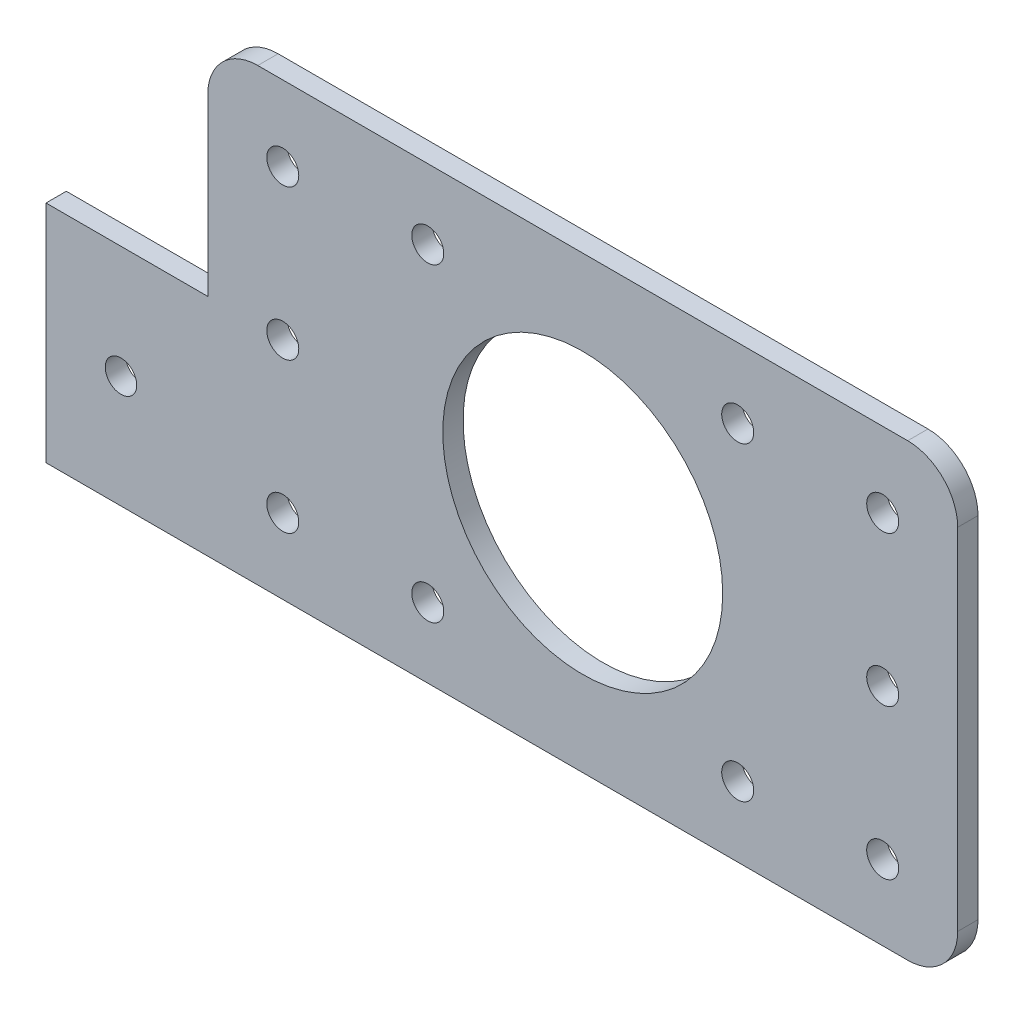
ISO-10303-21;
HEADER;
FILE_DESCRIPTION(('STEP AP214'),'2;1');
FILE_NAME('part.step','',(''),(''),'','','');
FILE_SCHEMA(('AUTOMOTIVE_DESIGN { 1 0 10303 214 1 1 1 1 }'));
ENDSEC;
DATA;
#1=APPLICATION_CONTEXT('core data for automotive mechanical design processes');
#2=APPLICATION_PROTOCOL_DEFINITION('international standard','automotive_design',2000,#1);
#3=PRODUCT_CONTEXT('',#1,'mechanical');
#4=PRODUCT('Part','Part','',(#3));
#5=PRODUCT_RELATED_PRODUCT_CATEGORY('part','',(#4));
#6=PRODUCT_DEFINITION_FORMATION('','',#4);
#7=PRODUCT_DEFINITION_CONTEXT('part definition',#1,'design');
#8=PRODUCT_DEFINITION('design','',#6,#7);
#9=PRODUCT_DEFINITION_SHAPE('','',#8);
#10=(LENGTH_UNIT() NAMED_UNIT(*) SI_UNIT(.MILLI.,.METRE.));
#11=(NAMED_UNIT(*) PLANE_ANGLE_UNIT() SI_UNIT($,.RADIAN.));
#12=(NAMED_UNIT(*) SI_UNIT($,.STERADIAN.) SOLID_ANGLE_UNIT());
#13=UNCERTAINTY_MEASURE_WITH_UNIT(LENGTH_MEASURE(1.E-05),#10,'distance_accuracy_value','');
#14=(GEOMETRIC_REPRESENTATION_CONTEXT(3) GLOBAL_UNCERTAINTY_ASSIGNED_CONTEXT((#13)) GLOBAL_UNIT_ASSIGNED_CONTEXT((#10,
#11,#12)) REPRESENTATION_CONTEXT('',''));
#15=CARTESIAN_POINT('',(0.,0.,0.));
#16=DIRECTION('',(0.,0.,1.));
#17=DIRECTION('',(1.,0.,0.));
#18=AXIS2_PLACEMENT_3D('',#15,#16,#17);
#19=CARTESIAN_POINT('',(0.,0.,2.032));
#20=DIRECTION('',(0.,0.,-1.));
#21=DIRECTION('',(-1.,0.,0.));
#22=AXIS2_PLACEMENT_3D('',#19,#20,#21);
#23=PLANE('',#22);
#24=CARTESIAN_POINT('',(-46.18,-11.25,2.032));
#25=DIRECTION('',(0.,0.,1.));
#26=DIRECTION('',(1.,0.,0.));
#27=AXIS2_PLACEMENT_3D('',#24,#25,#26);
#28=CIRCLE('',#27,1.575);
#29=CARTESIAN_POINT('',(-44.605,-11.25,2.032));
#30=VERTEX_POINT('',#29);
#31=EDGE_CURVE('E135',#30,#30,#28,.T.);
#32=ORIENTED_EDGE('',*,*,#31,.F.);
#33=EDGE_LOOP('',(#32));
#34=FACE_BOUND('',#33,.T.);
#35=DIRECTION('',(0.,-1.,0.));
#36=VECTOR('',#35,1.);
#37=CARTESIAN_POINT('',(-53.68,0.,2.032));
#38=LINE('',#37,#36);
#39=CARTESIAN_POINT('',(-53.68,0.,2.032));
#40=VERTEX_POINT('',#39);
#41=CARTESIAN_POINT('',(-53.68,-22.5,2.032));
#42=VERTEX_POINT('',#41);
#43=EDGE_CURVE('E141',#40,#42,#38,.T.);
#44=ORIENTED_EDGE('',*,*,#43,.T.);
#45=DIRECTION('',(1.,0.,0.));
#46=VECTOR('',#45,1.);
#47=CARTESIAN_POINT('',(-37.5,-22.5,2.032));
#48=LINE('',#47,#46);
#49=CARTESIAN_POINT('',(32.5,-22.5,2.032));
#50=VERTEX_POINT('',#49);
#51=EDGE_CURVE('E122',#42,#50,#48,.T.);
#52=ORIENTED_EDGE('',*,*,#51,.T.);
#53=CARTESIAN_POINT('',(32.5,-17.5,2.032));
#54=DIRECTION('',(0.,0.,-1.));
#55=DIRECTION('',(-1.,0.,0.));
#56=AXIS2_PLACEMENT_3D('',#53,#54,#55);
#57=CIRCLE('',#56,5.);
#58=CARTESIAN_POINT('',(37.5,-17.5,2.032));
#59=VERTEX_POINT('',#58);
#60=EDGE_CURVE('E240',#50,#59,#57,.F.);
#61=ORIENTED_EDGE('',*,*,#60,.T.);
#62=DIRECTION('',(0.,1.,0.));
#63=VECTOR('',#62,1.);
#64=CARTESIAN_POINT('',(37.5,-22.5,2.032));
#65=LINE('',#64,#63);
#66=CARTESIAN_POINT('',(37.5,17.5,2.032));
#67=VERTEX_POINT('',#66);
#68=EDGE_CURVE('E116',#59,#67,#65,.T.);
#69=ORIENTED_EDGE('',*,*,#68,.T.);
#70=CARTESIAN_POINT('',(32.5,17.5,2.032));
#71=DIRECTION('',(0.,0.,-1.));
#72=DIRECTION('',(-1.,0.,0.));
#73=AXIS2_PLACEMENT_3D('',#70,#71,#72);
#74=CIRCLE('',#73,5.);
#75=CARTESIAN_POINT('',(32.5,22.5,2.032));
#76=VERTEX_POINT('',#75);
#77=EDGE_CURVE('E242',#67,#76,#74,.F.);
#78=ORIENTED_EDGE('',*,*,#77,.T.);
#79=DIRECTION('',(-1.,0.,0.));
#80=VECTOR('',#79,1.);
#81=CARTESIAN_POINT('',(-37.5,22.5,2.032));
#82=LINE('',#81,#80);
#83=CARTESIAN_POINT('',(-32.5,22.5,2.032));
#84=VERTEX_POINT('',#83);
#85=EDGE_CURVE('E212',#76,#84,#82,.T.);
#86=ORIENTED_EDGE('',*,*,#85,.T.);
#87=CARTESIAN_POINT('',(-32.5,17.5,2.032));
#88=DIRECTION('',(0.,0.,-1.));
#89=DIRECTION('',(-1.,0.,0.));
#90=AXIS2_PLACEMENT_3D('',#87,#88,#89);
#91=CIRCLE('',#90,5.);
#92=CARTESIAN_POINT('',(-37.5,17.5,2.032));
#93=VERTEX_POINT('',#92);
#94=EDGE_CURVE('E56',#84,#93,#91,.F.);
#95=ORIENTED_EDGE('',*,*,#94,.T.);
#96=DIRECTION('',(0.,-1.,0.));
#97=VECTOR('',#96,1.);
#98=CARTESIAN_POINT('',(-37.5,-22.5,2.032));
#99=LINE('',#98,#97);
#100=CARTESIAN_POINT('',(-37.5,0.,2.032));
#101=VERTEX_POINT('',#100);
#102=EDGE_CURVE('E214',#93,#101,#99,.T.);
#103=ORIENTED_EDGE('',*,*,#102,.T.);
#104=DIRECTION('',(-1.,0.,0.));
#105=VECTOR('',#104,1.);
#106=CARTESIAN_POINT('',(-53.68,0.,2.032));
#107=LINE('',#106,#105);
#108=EDGE_CURVE('E138',#101,#40,#107,.T.);
#109=ORIENTED_EDGE('',*,*,#108,.T.);
#110=EDGE_LOOP('',(#44,#52,#61,#69,#78,#86,#95,#103,#109));
#111=FACE_BOUND('',#110,.T.);
#112=CARTESIAN_POINT('',(30.,0.,2.032));
#113=DIRECTION('',(0.,0.,1.));
#114=DIRECTION('',(-1.,0.,0.));
#115=AXIS2_PLACEMENT_3D('',#112,#113,#114);
#116=CIRCLE('',#115,1.60000000000001);
#117=CARTESIAN_POINT('',(28.4,0.,2.032));
#118=VERTEX_POINT('',#117);
#119=EDGE_CURVE('E147',#118,#118,#116,.T.);
#120=ORIENTED_EDGE('',*,*,#119,.F.);
#121=EDGE_LOOP('',(#120));
#122=FACE_BOUND('',#121,.T.);
#123=CARTESIAN_POINT('',(30.,15.,2.032));
#124=DIRECTION('',(0.,0.,1.));
#125=DIRECTION('',(-1.,0.,0.));
#126=AXIS2_PLACEMENT_3D('',#123,#124,#125);
#127=CIRCLE('',#126,1.6);
#128=CARTESIAN_POINT('',(28.4,15.,2.032));
#129=VERTEX_POINT('',#128);
#130=EDGE_CURVE('E146',#129,#129,#127,.T.);
#131=ORIENTED_EDGE('',*,*,#130,.F.);
#132=EDGE_LOOP('',(#131));
#133=FACE_BOUND('',#132,.T.);
#134=CARTESIAN_POINT('',(30.,-15.,2.032));
#135=DIRECTION('',(0.,0.,1.));
#136=DIRECTION('',(1.,0.,0.));
#137=AXIS2_PLACEMENT_3D('',#134,#135,#136);
#138=CIRCLE('',#137,1.60000000000001);
#139=CARTESIAN_POINT('',(31.6,-15.,2.032));
#140=VERTEX_POINT('',#139);
#141=EDGE_CURVE('E153',#140,#140,#138,.T.);
#142=ORIENTED_EDGE('',*,*,#141,.F.);
#143=EDGE_LOOP('',(#142));
#144=FACE_BOUND('',#143,.T.);
#145=CARTESIAN_POINT('',(-30.,-15.,2.032));
#146=DIRECTION('',(0.,0.,1.));
#147=DIRECTION('',(-1.,0.,0.));
#148=AXIS2_PLACEMENT_3D('',#145,#146,#147);
#149=CIRCLE('',#148,1.6);
#150=CARTESIAN_POINT('',(-31.6,-15.,2.032));
#151=VERTEX_POINT('',#150);
#152=EDGE_CURVE('E159',#151,#151,#149,.T.);
#153=ORIENTED_EDGE('',*,*,#152,.F.);
#154=EDGE_LOOP('',(#153));
#155=FACE_BOUND('',#154,.T.);
#156=CARTESIAN_POINT('',(-30.,15.,2.032));
#157=DIRECTION('',(0.,0.,1.));
#158=DIRECTION('',(1.,0.,0.));
#159=AXIS2_PLACEMENT_3D('',#156,#157,#158);
#160=CIRCLE('',#159,1.6);
#161=CARTESIAN_POINT('',(-28.4,15.,2.032));
#162=VERTEX_POINT('',#161);
#163=EDGE_CURVE('E165',#162,#162,#160,.T.);
#164=ORIENTED_EDGE('',*,*,#163,.F.);
#165=EDGE_LOOP('',(#164));
#166=FACE_BOUND('',#165,.T.);
#167=CARTESIAN_POINT('',(-30.,0.,2.032));
#168=DIRECTION('',(0.,0.,1.));
#169=DIRECTION('',(1.,0.,0.));
#170=AXIS2_PLACEMENT_3D('',#167,#168,#169);
#171=CIRCLE('',#170,1.60000000000001);
#172=CARTESIAN_POINT('',(-28.4,0.,2.032));
#173=VERTEX_POINT('',#172);
#174=EDGE_CURVE('E171',#173,#173,#171,.T.);
#175=ORIENTED_EDGE('',*,*,#174,.F.);
#176=EDGE_LOOP('',(#175));
#177=FACE_BOUND('',#176,.T.);
#178=CARTESIAN_POINT('',(15.5,-15.5,2.032));
#179=DIRECTION('',(0.,0.,1.));
#180=DIRECTION('',(1.,0.,0.));
#181=AXIS2_PLACEMENT_3D('',#178,#179,#180);
#182=CIRCLE('',#181,1.6);
#183=CARTESIAN_POINT('',(17.1,-15.5,2.032));
#184=VERTEX_POINT('',#183);
#185=EDGE_CURVE('E186',#184,#184,#182,.T.);
#186=ORIENTED_EDGE('',*,*,#185,.F.);
#187=EDGE_LOOP('',(#186));
#188=FACE_BOUND('',#187,.T.);
#189=CARTESIAN_POINT('',(-15.5,15.5,2.032));
#190=DIRECTION('',(0.,0.,1.));
#191=DIRECTION('',(1.,0.,0.));
#192=AXIS2_PLACEMENT_3D('',#189,#190,#191);
#193=CIRCLE('',#192,1.6);
#194=CARTESIAN_POINT('',(-13.9,15.5,2.032));
#195=VERTEX_POINT('',#194);
#196=EDGE_CURVE('E198',#195,#195,#193,.T.);
#197=ORIENTED_EDGE('',*,*,#196,.F.);
#198=EDGE_LOOP('',(#197));
#199=FACE_BOUND('',#198,.T.);
#200=CARTESIAN_POINT('',(0.,0.,2.032));
#201=DIRECTION('',(0.,0.,1.));
#202=DIRECTION('',(1.,0.,0.));
#203=AXIS2_PLACEMENT_3D('',#200,#201,#202);
#204=CIRCLE('',#203,14.);
#205=CARTESIAN_POINT('',(14.,0.,2.032));
#206=VERTEX_POINT('',#205);
#207=EDGE_CURVE('E204',#206,#206,#204,.T.);
#208=ORIENTED_EDGE('',*,*,#207,.F.);
#209=EDGE_LOOP('',(#208));
#210=FACE_BOUND('',#209,.T.);
#211=CARTESIAN_POINT('',(15.5,15.5,2.032));
#212=DIRECTION('',(0.,0.,1.));
#213=DIRECTION('',(1.,0.,0.));
#214=AXIS2_PLACEMENT_3D('',#211,#212,#213);
#215=CIRCLE('',#214,1.6);
#216=CARTESIAN_POINT('',(17.1,15.5,2.032));
#217=VERTEX_POINT('',#216);
#218=EDGE_CURVE('E192',#217,#217,#215,.T.);
#219=ORIENTED_EDGE('',*,*,#218,.F.);
#220=EDGE_LOOP('',(#219));
#221=FACE_BOUND('',#220,.T.);
#222=CARTESIAN_POINT('',(-15.5,-15.5,2.032));
#223=DIRECTION('',(0.,0.,1.));
#224=DIRECTION('',(1.,0.,0.));
#225=AXIS2_PLACEMENT_3D('',#222,#223,#224);
#226=CIRCLE('',#225,1.6);
#227=CARTESIAN_POINT('',(-13.9,-15.5,2.032));
#228=VERTEX_POINT('',#227);
#229=EDGE_CURVE('E180',#228,#228,#226,.T.);
#230=ORIENTED_EDGE('',*,*,#229,.F.);
#231=EDGE_LOOP('',(#230));
#232=FACE_BOUND('',#231,.T.);
#233=ADVANCED_FACE('F33',(#34,#111,#122,#133,#144,#155,#166,#177,#188,#199,#210,#221,#232),#23,.F.);
#234=CARTESIAN_POINT('',(0.,0.,0.));
#235=DIRECTION('',(0.,0.,-1.));
#236=DIRECTION('',(-1.,0.,0.));
#237=AXIS2_PLACEMENT_3D('',#234,#235,#236);
#238=PLANE('',#237);
#239=CARTESIAN_POINT('',(-46.18,-11.25,0.));
#240=DIRECTION('',(0.,0.,1.));
#241=DIRECTION('',(1.,0.,0.));
#242=AXIS2_PLACEMENT_3D('',#239,#240,#241);
#243=CIRCLE('',#242,1.575);
#244=CARTESIAN_POINT('',(-44.605,-11.25,0.));
#245=VERTEX_POINT('',#244);
#246=EDGE_CURVE('E131',#245,#245,#243,.T.);
#247=ORIENTED_EDGE('',*,*,#246,.T.);
#248=EDGE_LOOP('',(#247));
#249=FACE_BOUND('',#248,.T.);
#250=DIRECTION('',(1.,0.,0.));
#251=VECTOR('',#250,1.);
#252=CARTESIAN_POINT('',(-37.5,-22.5,0.));
#253=LINE('',#252,#251);
#254=CARTESIAN_POINT('',(-53.68,-22.5,0.));
#255=VERTEX_POINT('',#254);
#256=CARTESIAN_POINT('',(32.5,-22.5,0.));
#257=VERTEX_POINT('',#256);
#258=EDGE_CURVE('E106',#255,#257,#253,.T.);
#259=ORIENTED_EDGE('',*,*,#258,.F.);
#260=DIRECTION('',(0.,1.,0.));
#261=VECTOR('',#260,1.);
#262=CARTESIAN_POINT('',(-53.68,0.,0.));
#263=LINE('',#262,#261);
#264=CARTESIAN_POINT('',(-53.68,0.,0.));
#265=VERTEX_POINT('',#264);
#266=EDGE_CURVE('E112',#255,#265,#263,.T.);
#267=ORIENTED_EDGE('',*,*,#266,.T.);
#268=DIRECTION('',(1.,0.,0.));
#269=VECTOR('',#268,1.);
#270=CARTESIAN_POINT('',(-53.68,0.,0.));
#271=LINE('',#270,#269);
#272=CARTESIAN_POINT('',(-37.5,0.,0.));
#273=VERTEX_POINT('',#272);
#274=EDGE_CURVE('E127',#265,#273,#271,.T.);
#275=ORIENTED_EDGE('',*,*,#274,.T.);
#276=DIRECTION('',(0.,-1.,0.));
#277=VECTOR('',#276,1.);
#278=CARTESIAN_POINT('',(-37.5,-22.5,0.));
#279=LINE('',#278,#277);
#280=CARTESIAN_POINT('',(-37.5,17.5,0.));
#281=VERTEX_POINT('',#280);
#282=EDGE_CURVE('E117',#281,#273,#279,.T.);
#283=ORIENTED_EDGE('',*,*,#282,.F.);
#284=CARTESIAN_POINT('',(-32.5,17.5,0.));
#285=DIRECTION('',(0.,0.,-1.));
#286=DIRECTION('',(-1.,0.,0.));
#287=AXIS2_PLACEMENT_3D('',#284,#285,#286);
#288=CIRCLE('',#287,5.);
#289=CARTESIAN_POINT('',(-32.5,22.5,0.));
#290=VERTEX_POINT('',#289);
#291=EDGE_CURVE('E229',#281,#290,#288,.T.);
#292=ORIENTED_EDGE('',*,*,#291,.T.);
#293=DIRECTION('',(-1.,0.,0.));
#294=VECTOR('',#293,1.);
#295=CARTESIAN_POINT('',(-37.5,22.5,0.));
#296=LINE('',#295,#294);
#297=CARTESIAN_POINT('',(32.5,22.5,0.));
#298=VERTEX_POINT('',#297);
#299=EDGE_CURVE('E220',#298,#290,#296,.T.);
#300=ORIENTED_EDGE('',*,*,#299,.F.);
#301=CARTESIAN_POINT('',(32.5,17.5,0.));
#302=DIRECTION('',(0.,0.,-1.));
#303=DIRECTION('',(-1.,0.,0.));
#304=AXIS2_PLACEMENT_3D('',#301,#302,#303);
#305=CIRCLE('',#304,5.);
#306=CARTESIAN_POINT('',(37.5,17.5,0.));
#307=VERTEX_POINT('',#306);
#308=EDGE_CURVE('E232',#298,#307,#305,.T.);
#309=ORIENTED_EDGE('',*,*,#308,.T.);
#310=DIRECTION('',(0.,1.,0.));
#311=VECTOR('',#310,1.);
#312=CARTESIAN_POINT('',(37.5,-22.5,0.));
#313=LINE('',#312,#311);
#314=CARTESIAN_POINT('',(37.5,-17.5,0.));
#315=VERTEX_POINT('',#314);
#316=EDGE_CURVE('E207',#315,#307,#313,.T.);
#317=ORIENTED_EDGE('',*,*,#316,.F.);
#318=CARTESIAN_POINT('',(32.5,-17.5,0.));
#319=DIRECTION('',(0.,0.,-1.));
#320=DIRECTION('',(-1.,0.,0.));
#321=AXIS2_PLACEMENT_3D('',#318,#319,#320);
#322=CIRCLE('',#321,5.);
#323=EDGE_CURVE('E115',#315,#257,#322,.T.);
#324=ORIENTED_EDGE('',*,*,#323,.T.);
#325=EDGE_LOOP('',(#259,#267,#275,#283,#292,#300,#309,#317,#324));
#326=FACE_BOUND('',#325,.T.);
#327=CARTESIAN_POINT('',(30.,0.,0.));
#328=DIRECTION('',(0.,0.,1.));
#329=DIRECTION('',(-1.,0.,0.));
#330=AXIS2_PLACEMENT_3D('',#327,#328,#329);
#331=CIRCLE('',#330,1.60000000000001);
#332=CARTESIAN_POINT('',(28.4,0.,0.));
#333=VERTEX_POINT('',#332);
#334=EDGE_CURVE('E143',#333,#333,#331,.T.);
#335=ORIENTED_EDGE('',*,*,#334,.T.);
#336=EDGE_LOOP('',(#335));
#337=FACE_BOUND('',#336,.T.);
#338=CARTESIAN_POINT('',(30.,15.,0.));
#339=DIRECTION('',(0.,0.,1.));
#340=DIRECTION('',(-1.,0.,0.));
#341=AXIS2_PLACEMENT_3D('',#338,#339,#340);
#342=CIRCLE('',#341,1.6);
#343=CARTESIAN_POINT('',(28.4,15.,0.));
#344=VERTEX_POINT('',#343);
#345=EDGE_CURVE('E150',#344,#344,#342,.T.);
#346=ORIENTED_EDGE('',*,*,#345,.T.);
#347=EDGE_LOOP('',(#346));
#348=FACE_BOUND('',#347,.T.);
#349=CARTESIAN_POINT('',(30.,-15.,0.));
#350=DIRECTION('',(0.,0.,1.));
#351=DIRECTION('',(1.,0.,0.));
#352=AXIS2_PLACEMENT_3D('',#349,#350,#351);
#353=CIRCLE('',#352,1.60000000000001);
#354=CARTESIAN_POINT('',(31.6,-15.,0.));
#355=VERTEX_POINT('',#354);
#356=EDGE_CURVE('E156',#355,#355,#353,.T.);
#357=ORIENTED_EDGE('',*,*,#356,.T.);
#358=EDGE_LOOP('',(#357));
#359=FACE_BOUND('',#358,.T.);
#360=CARTESIAN_POINT('',(-30.,-15.,0.));
#361=DIRECTION('',(0.,0.,1.));
#362=DIRECTION('',(-1.,0.,0.));
#363=AXIS2_PLACEMENT_3D('',#360,#361,#362);
#364=CIRCLE('',#363,1.6);
#365=CARTESIAN_POINT('',(-31.6,-15.,0.));
#366=VERTEX_POINT('',#365);
#367=EDGE_CURVE('E162',#366,#366,#364,.T.);
#368=ORIENTED_EDGE('',*,*,#367,.T.);
#369=EDGE_LOOP('',(#368));
#370=FACE_BOUND('',#369,.T.);
#371=CARTESIAN_POINT('',(-30.,15.,0.));
#372=DIRECTION('',(0.,0.,1.));
#373=DIRECTION('',(1.,0.,0.));
#374=AXIS2_PLACEMENT_3D('',#371,#372,#373);
#375=CIRCLE('',#374,1.6);
#376=CARTESIAN_POINT('',(-28.4,15.,0.));
#377=VERTEX_POINT('',#376);
#378=EDGE_CURVE('E168',#377,#377,#375,.T.);
#379=ORIENTED_EDGE('',*,*,#378,.T.);
#380=EDGE_LOOP('',(#379));
#381=FACE_BOUND('',#380,.T.);
#382=CARTESIAN_POINT('',(-30.,0.,0.));
#383=DIRECTION('',(0.,0.,1.));
#384=DIRECTION('',(1.,0.,0.));
#385=AXIS2_PLACEMENT_3D('',#382,#383,#384);
#386=CIRCLE('',#385,1.60000000000001);
#387=CARTESIAN_POINT('',(-28.4,0.,0.));
#388=VERTEX_POINT('',#387);
#389=EDGE_CURVE('E174',#388,#388,#386,.T.);
#390=ORIENTED_EDGE('',*,*,#389,.T.);
#391=EDGE_LOOP('',(#390));
#392=FACE_BOUND('',#391,.T.);
#393=CARTESIAN_POINT('',(15.5,-15.5,0.));
#394=DIRECTION('',(0.,0.,1.));
#395=DIRECTION('',(1.,0.,0.));
#396=AXIS2_PLACEMENT_3D('',#393,#394,#395);
#397=CIRCLE('',#396,1.6);
#398=CARTESIAN_POINT('',(17.1,-15.5,0.));
#399=VERTEX_POINT('',#398);
#400=EDGE_CURVE('E183',#399,#399,#397,.T.);
#401=ORIENTED_EDGE('',*,*,#400,.T.);
#402=EDGE_LOOP('',(#401));
#403=FACE_BOUND('',#402,.T.);
#404=CARTESIAN_POINT('',(-15.5,15.5,0.));
#405=DIRECTION('',(0.,0.,1.));
#406=DIRECTION('',(1.,0.,0.));
#407=AXIS2_PLACEMENT_3D('',#404,#405,#406);
#408=CIRCLE('',#407,1.6);
#409=CARTESIAN_POINT('',(-13.9,15.5,0.));
#410=VERTEX_POINT('',#409);
#411=EDGE_CURVE('E195',#410,#410,#408,.T.);
#412=ORIENTED_EDGE('',*,*,#411,.T.);
#413=EDGE_LOOP('',(#412));
#414=FACE_BOUND('',#413,.T.);
#415=CARTESIAN_POINT('',(0.,0.,0.));
#416=DIRECTION('',(0.,0.,1.));
#417=DIRECTION('',(1.,0.,0.));
#418=AXIS2_PLACEMENT_3D('',#415,#416,#417);
#419=CIRCLE('',#418,14.);
#420=CARTESIAN_POINT('',(14.,0.,0.));
#421=VERTEX_POINT('',#420);
#422=EDGE_CURVE('E201',#421,#421,#419,.T.);
#423=ORIENTED_EDGE('',*,*,#422,.T.);
#424=EDGE_LOOP('',(#423));
#425=FACE_BOUND('',#424,.T.);
#426=CARTESIAN_POINT('',(15.5,15.5,0.));
#427=DIRECTION('',(0.,0.,1.));
#428=DIRECTION('',(1.,0.,0.));
#429=AXIS2_PLACEMENT_3D('',#426,#427,#428);
#430=CIRCLE('',#429,1.6);
#431=CARTESIAN_POINT('',(17.1,15.5,0.));
#432=VERTEX_POINT('',#431);
#433=EDGE_CURVE('E189',#432,#432,#430,.T.);
#434=ORIENTED_EDGE('',*,*,#433,.T.);
#435=EDGE_LOOP('',(#434));
#436=FACE_BOUND('',#435,.T.);
#437=CARTESIAN_POINT('',(-15.5,-15.5,0.));
#438=DIRECTION('',(0.,0.,1.));
#439=DIRECTION('',(1.,0.,0.));
#440=AXIS2_PLACEMENT_3D('',#437,#438,#439);
#441=CIRCLE('',#440,1.6);
#442=CARTESIAN_POINT('',(-13.9,-15.5,0.));
#443=VERTEX_POINT('',#442);
#444=EDGE_CURVE('E177',#443,#443,#441,.T.);
#445=ORIENTED_EDGE('',*,*,#444,.T.);
#446=EDGE_LOOP('',(#445));
#447=FACE_BOUND('',#446,.T.);
#448=ADVANCED_FACE('F108',(#249,#326,#337,#348,#359,#370,#381,#392,#403,#414,#425,#436,#447),
#238,.T.);
#449=CARTESIAN_POINT('',(37.5,-22.5,2.032));
#450=DIRECTION('',(-1.,0.,0.));
#451=DIRECTION('',(0.,0.,1.));
#452=AXIS2_PLACEMENT_3D('',#449,#450,#451);
#453=PLANE('',#452);
#454=ORIENTED_EDGE('',*,*,#316,.T.);
#455=DIRECTION('',(0.,0.,-1.));
#456=VECTOR('',#455,1.);
#457=CARTESIAN_POINT('',(37.5,17.5,2.032));
#458=LINE('',#457,#456);
#459=EDGE_CURVE('E237',#307,#67,#458,.F.);
#460=ORIENTED_EDGE('',*,*,#459,.T.);
#461=ORIENTED_EDGE('',*,*,#68,.F.);
#462=DIRECTION('',(0.,0.,-1.));
#463=VECTOR('',#462,1.);
#464=CARTESIAN_POINT('',(37.5,-17.5,2.032));
#465=LINE('',#464,#463);
#466=EDGE_CURVE('E234',#59,#315,#465,.T.);
#467=ORIENTED_EDGE('',*,*,#466,.T.);
#468=EDGE_LOOP('',(#454,#460,#461,#467));
#469=FACE_BOUND('',#468,.T.);
#470=ADVANCED_FACE('F266',(#469),#453,.F.);
#471=CARTESIAN_POINT('',(-37.5,22.5,2.032));
#472=DIRECTION('',(0.,-1.,0.));
#473=DIRECTION('',(0.,0.,-1.));
#474=AXIS2_PLACEMENT_3D('',#471,#472,#473);
#475=PLANE('',#474);
#476=ORIENTED_EDGE('',*,*,#85,.F.);
#477=DIRECTION('',(0.,0.,-1.));
#478=VECTOR('',#477,1.);
#479=CARTESIAN_POINT('',(32.5,22.5,2.032));
#480=LINE('',#479,#478);
#481=EDGE_CURVE('E226',#76,#298,#480,.T.);
#482=ORIENTED_EDGE('',*,*,#481,.T.);
#483=ORIENTED_EDGE('',*,*,#299,.T.);
#484=DIRECTION('',(0.,0.,-1.));
#485=VECTOR('',#484,1.);
#486=CARTESIAN_POINT('',(-32.5,22.5,2.032));
#487=LINE('',#486,#485);
#488=EDGE_CURVE('E217',#290,#84,#487,.F.);
#489=ORIENTED_EDGE('',*,*,#488,.T.);
#490=EDGE_LOOP('',(#476,#482,#483,#489));
#491=FACE_BOUND('',#490,.T.);
#492=ADVANCED_FACE('F277',(#491),#475,.F.);
#493=CARTESIAN_POINT('',(-37.5,-22.5,2.032));
#494=DIRECTION('',(1.,0.,0.));
#495=DIRECTION('',(0.,0.,-1.));
#496=AXIS2_PLACEMENT_3D('',#493,#494,#495);
#497=PLANE('',#496);
#498=ORIENTED_EDGE('',*,*,#282,.T.);
#499=DIRECTION('',(0.,0.,1.));
#500=VECTOR('',#499,1.);
#501=CARTESIAN_POINT('',(-37.5,0.,2.032));
#502=LINE('',#501,#500);
#503=EDGE_CURVE('E11',#273,#101,#502,.T.);
#504=ORIENTED_EDGE('',*,*,#503,.T.);
#505=ORIENTED_EDGE('',*,*,#102,.F.);
#506=DIRECTION('',(0.,0.,-1.));
#507=VECTOR('',#506,1.);
#508=CARTESIAN_POINT('',(-37.5,17.5,2.032));
#509=LINE('',#508,#507);
#510=EDGE_CURVE('E41',#93,#281,#509,.T.);
#511=ORIENTED_EDGE('',*,*,#510,.T.);
#512=EDGE_LOOP('',(#498,#504,#505,#511));
#513=FACE_BOUND('',#512,.T.);
#514=ADVANCED_FACE('F248',(#513),#497,.F.);
#515=CARTESIAN_POINT('',(-37.5,-22.5,2.032));
#516=DIRECTION('',(0.,1.,0.));
#517=DIRECTION('',(0.,0.,1.));
#518=AXIS2_PLACEMENT_3D('',#515,#516,#517);
#519=PLANE('',#518);
#520=ORIENTED_EDGE('',*,*,#258,.T.);
#521=DIRECTION('',(0.,0.,-1.));
#522=VECTOR('',#521,1.);
#523=CARTESIAN_POINT('',(32.5,-22.5,2.032));
#524=LINE('',#523,#522);
#525=EDGE_CURVE('E48',#257,#50,#524,.F.);
#526=ORIENTED_EDGE('',*,*,#525,.T.);
#527=ORIENTED_EDGE('',*,*,#51,.F.);
#528=DIRECTION('',(0.,0.,-1.));
#529=VECTOR('',#528,1.);
#530=CARTESIAN_POINT('',(-53.68,-22.5,32.9325242673971));
#531=LINE('',#530,#529);
#532=EDGE_CURVE('E120',#42,#255,#531,.T.);
#533=ORIENTED_EDGE('',*,*,#532,.T.);
#534=EDGE_LOOP('',(#520,#526,#527,#533));
#535=FACE_BOUND('',#534,.T.);
#536=ADVANCED_FACE('F121',(#535),#519,.F.);
#537=CARTESIAN_POINT('',(0.,0.,2.032));
#538=DIRECTION('',(0.,0.,-1.));
#539=DIRECTION('',(-1.,0.,0.));
#540=AXIS2_PLACEMENT_3D('',#537,#538,#539);
#541=CYLINDRICAL_SURFACE('',#540,14.);
#542=ORIENTED_EDGE('',*,*,#207,.T.);
#543=EDGE_LOOP('',(#542));
#544=FACE_BOUND('',#543,.T.);
#545=ORIENTED_EDGE('',*,*,#422,.F.);
#546=EDGE_LOOP('',(#545));
#547=FACE_BOUND('',#546,.T.);
#548=ADVANCED_FACE('F270',(#544,#547),#541,.F.);
#549=CARTESIAN_POINT('',(-15.5,15.5,2.032));
#550=DIRECTION('',(0.,0.,-1.));
#551=DIRECTION('',(-1.,0.,0.));
#552=AXIS2_PLACEMENT_3D('',#549,#550,#551);
#553=CYLINDRICAL_SURFACE('',#552,1.6);
#554=ORIENTED_EDGE('',*,*,#196,.T.);
#555=EDGE_LOOP('',(#554));
#556=FACE_BOUND('',#555,.T.);
#557=ORIENTED_EDGE('',*,*,#411,.F.);
#558=EDGE_LOOP('',(#557));
#559=FACE_BOUND('',#558,.T.);
#560=ADVANCED_FACE('F328',(#556,#559),#553,.F.);
#561=CARTESIAN_POINT('',(15.5,15.5,2.032));
#562=DIRECTION('',(0.,0.,-1.));
#563=DIRECTION('',(-1.,0.,0.));
#564=AXIS2_PLACEMENT_3D('',#561,#562,#563);
#565=CYLINDRICAL_SURFACE('',#564,1.6);
#566=ORIENTED_EDGE('',*,*,#218,.T.);
#567=EDGE_LOOP('',(#566));
#568=FACE_BOUND('',#567,.T.);
#569=ORIENTED_EDGE('',*,*,#433,.F.);
#570=EDGE_LOOP('',(#569));
#571=FACE_BOUND('',#570,.T.);
#572=ADVANCED_FACE('F325',(#568,#571),#565,.F.);
#573=CARTESIAN_POINT('',(15.5,-15.5,2.032));
#574=DIRECTION('',(0.,0.,-1.));
#575=DIRECTION('',(-1.,0.,0.));
#576=AXIS2_PLACEMENT_3D('',#573,#574,#575);
#577=CYLINDRICAL_SURFACE('',#576,1.6);
#578=ORIENTED_EDGE('',*,*,#185,.T.);
#579=EDGE_LOOP('',(#578));
#580=FACE_BOUND('',#579,.T.);
#581=ORIENTED_EDGE('',*,*,#400,.F.);
#582=EDGE_LOOP('',(#581));
#583=FACE_BOUND('',#582,.T.);
#584=ADVANCED_FACE('F321',(#580,#583),#577,.F.);
#585=CARTESIAN_POINT('',(-15.5,-15.5,2.032));
#586=DIRECTION('',(0.,0.,-1.));
#587=DIRECTION('',(-1.,0.,0.));
#588=AXIS2_PLACEMENT_3D('',#585,#586,#587);
#589=CYLINDRICAL_SURFACE('',#588,1.6);
#590=ORIENTED_EDGE('',*,*,#229,.T.);
#591=EDGE_LOOP('',(#590));
#592=FACE_BOUND('',#591,.T.);
#593=ORIENTED_EDGE('',*,*,#444,.F.);
#594=EDGE_LOOP('',(#593));
#595=FACE_BOUND('',#594,.T.);
#596=ADVANCED_FACE('F287',(#592,#595),#589,.F.);
#597=CARTESIAN_POINT('',(32.5,17.5,2.032));
#598=DIRECTION('',(0.,0.,-1.));
#599=DIRECTION('',(-1.,0.,0.));
#600=AXIS2_PLACEMENT_3D('',#597,#598,#599);
#601=CYLINDRICAL_SURFACE('',#600,5.);
#602=ORIENTED_EDGE('',*,*,#77,.F.);
#603=ORIENTED_EDGE('',*,*,#459,.F.);
#604=ORIENTED_EDGE('',*,*,#308,.F.);
#605=ORIENTED_EDGE('',*,*,#481,.F.);
#606=EDGE_LOOP('',(#602,#603,#604,#605));
#607=FACE_BOUND('',#606,.T.);
#608=ADVANCED_FACE('F284',(#607),#601,.T.);
#609=CARTESIAN_POINT('',(32.5,-17.5,2.032));
#610=DIRECTION('',(0.,0.,-1.));
#611=DIRECTION('',(-1.,0.,0.));
#612=AXIS2_PLACEMENT_3D('',#609,#610,#611);
#613=CYLINDRICAL_SURFACE('',#612,5.);
#614=ORIENTED_EDGE('',*,*,#60,.F.);
#615=ORIENTED_EDGE('',*,*,#525,.F.);
#616=ORIENTED_EDGE('',*,*,#323,.F.);
#617=ORIENTED_EDGE('',*,*,#466,.F.);
#618=EDGE_LOOP('',(#614,#615,#616,#617));
#619=FACE_BOUND('',#618,.T.);
#620=ADVANCED_FACE('F286',(#619),#613,.T.);
#621=CARTESIAN_POINT('',(-32.5,17.5,2.032));
#622=DIRECTION('',(0.,0.,-1.));
#623=DIRECTION('',(-1.,0.,0.));
#624=AXIS2_PLACEMENT_3D('',#621,#622,#623);
#625=CYLINDRICAL_SURFACE('',#624,5.);
#626=ORIENTED_EDGE('',*,*,#94,.F.);
#627=ORIENTED_EDGE('',*,*,#488,.F.);
#628=ORIENTED_EDGE('',*,*,#291,.F.);
#629=ORIENTED_EDGE('',*,*,#510,.F.);
#630=EDGE_LOOP('',(#626,#627,#628,#629));
#631=FACE_BOUND('',#630,.T.);
#632=ADVANCED_FACE('F35',(#631),#625,.T.);
#633=CARTESIAN_POINT('',(-30.,0.,0.));
#634=DIRECTION('',(0.,0.,1.));
#635=DIRECTION('',(1.,0.,0.));
#636=AXIS2_PLACEMENT_3D('',#633,#634,#635);
#637=CYLINDRICAL_SURFACE('',#636,1.60000000000001);
#638=ORIENTED_EDGE('',*,*,#389,.F.);
#639=EDGE_LOOP('',(#638));
#640=FACE_BOUND('',#639,.T.);
#641=ORIENTED_EDGE('',*,*,#174,.T.);
#642=EDGE_LOOP('',(#641));
#643=FACE_BOUND('',#642,.T.);
#644=ADVANCED_FACE('F294',(#640,#643),#637,.F.);
#645=CARTESIAN_POINT('',(-30.,15.,0.));
#646=DIRECTION('',(0.,0.,1.));
#647=DIRECTION('',(1.,0.,0.));
#648=AXIS2_PLACEMENT_3D('',#645,#646,#647);
#649=CYLINDRICAL_SURFACE('',#648,1.6);
#650=ORIENTED_EDGE('',*,*,#378,.F.);
#651=EDGE_LOOP('',(#650));
#652=FACE_BOUND('',#651,.T.);
#653=ORIENTED_EDGE('',*,*,#163,.T.);
#654=EDGE_LOOP('',(#653));
#655=FACE_BOUND('',#654,.T.);
#656=ADVANCED_FACE('F306',(#652,#655),#649,.F.);
#657=CARTESIAN_POINT('',(-30.,-15.,0.));
#658=DIRECTION('',(0.,0.,1.));
#659=DIRECTION('',(1.,0.,0.));
#660=AXIS2_PLACEMENT_3D('',#657,#658,#659);
#661=CYLINDRICAL_SURFACE('',#660,1.6);
#662=ORIENTED_EDGE('',*,*,#367,.F.);
#663=EDGE_LOOP('',(#662));
#664=FACE_BOUND('',#663,.T.);
#665=ORIENTED_EDGE('',*,*,#152,.T.);
#666=EDGE_LOOP('',(#665));
#667=FACE_BOUND('',#666,.T.);
#668=ADVANCED_FACE('F312',(#664,#667),#661,.F.);
#669=CARTESIAN_POINT('',(30.,-15.,0.));
#670=DIRECTION('',(0.,0.,1.));
#671=DIRECTION('',(1.,0.,0.));
#672=AXIS2_PLACEMENT_3D('',#669,#670,#671);
#673=CYLINDRICAL_SURFACE('',#672,1.60000000000001);
#674=ORIENTED_EDGE('',*,*,#356,.F.);
#675=EDGE_LOOP('',(#674));
#676=FACE_BOUND('',#675,.T.);
#677=ORIENTED_EDGE('',*,*,#141,.T.);
#678=EDGE_LOOP('',(#677));
#679=FACE_BOUND('',#678,.T.);
#680=ADVANCED_FACE('F410',(#676,#679),#673,.F.);
#681=CARTESIAN_POINT('',(30.,15.,0.));
#682=DIRECTION('',(0.,0.,1.));
#683=DIRECTION('',(1.,0.,0.));
#684=AXIS2_PLACEMENT_3D('',#681,#682,#683);
#685=CYLINDRICAL_SURFACE('',#684,1.6);
#686=ORIENTED_EDGE('',*,*,#345,.F.);
#687=EDGE_LOOP('',(#686));
#688=FACE_BOUND('',#687,.T.);
#689=ORIENTED_EDGE('',*,*,#130,.T.);
#690=EDGE_LOOP('',(#689));
#691=FACE_BOUND('',#690,.T.);
#692=ADVANCED_FACE('F401',(#688,#691),#685,.F.);
#693=CARTESIAN_POINT('',(30.,0.,0.));
#694=DIRECTION('',(0.,0.,1.));
#695=DIRECTION('',(1.,0.,0.));
#696=AXIS2_PLACEMENT_3D('',#693,#694,#695);
#697=CYLINDRICAL_SURFACE('',#696,1.60000000000001);
#698=ORIENTED_EDGE('',*,*,#334,.F.);
#699=EDGE_LOOP('',(#698));
#700=FACE_BOUND('',#699,.T.);
#701=ORIENTED_EDGE('',*,*,#119,.T.);
#702=EDGE_LOOP('',(#701));
#703=FACE_BOUND('',#702,.T.);
#704=ADVANCED_FACE('F396',(#700,#703),#697,.F.);
#705=CARTESIAN_POINT('',(-53.68,0.,32.9325242673971));
#706=DIRECTION('',(0.,1.,0.));
#707=DIRECTION('',(-1.,0.,0.));
#708=AXIS2_PLACEMENT_3D('',#705,#706,#707);
#709=PLANE('',#708);
#710=ORIENTED_EDGE('',*,*,#503,.F.);
#711=ORIENTED_EDGE('',*,*,#274,.F.);
#712=DIRECTION('',(0.,0.,-1.));
#713=VECTOR('',#712,1.);
#714=CARTESIAN_POINT('',(-53.68,0.,32.9325242673971));
#715=LINE('',#714,#713);
#716=EDGE_CURVE('E126',#40,#265,#715,.T.);
#717=ORIENTED_EDGE('',*,*,#716,.F.);
#718=ORIENTED_EDGE('',*,*,#108,.F.);
#719=EDGE_LOOP('',(#710,#711,#717,#718));
#720=FACE_BOUND('',#719,.T.);
#721=ADVANCED_FACE('F252',(#720),#709,.T.);
#722=CARTESIAN_POINT('',(-53.68,0.,32.9325242673971));
#723=DIRECTION('',(-1.,0.,0.));
#724=DIRECTION('',(0.,0.,1.));
#725=AXIS2_PLACEMENT_3D('',#722,#723,#724);
#726=PLANE('',#725);
#727=ORIENTED_EDGE('',*,*,#43,.F.);
#728=ORIENTED_EDGE('',*,*,#716,.T.);
#729=ORIENTED_EDGE('',*,*,#266,.F.);
#730=ORIENTED_EDGE('',*,*,#532,.F.);
#731=EDGE_LOOP('',(#727,#728,#729,#730));
#732=FACE_BOUND('',#731,.T.);
#733=ADVANCED_FACE('F129',(#732),#726,.T.);
#734=CARTESIAN_POINT('',(-46.18,-11.25,0.));
#735=DIRECTION('',(0.,0.,1.));
#736=DIRECTION('',(1.,0.,0.));
#737=AXIS2_PLACEMENT_3D('',#734,#735,#736);
#738=CYLINDRICAL_SURFACE('',#737,1.575);
#739=ORIENTED_EDGE('',*,*,#246,.F.);
#740=EDGE_LOOP('',(#739));
#741=FACE_BOUND('',#740,.T.);
#742=ORIENTED_EDGE('',*,*,#31,.T.);
#743=EDGE_LOOP('',(#742));
#744=FACE_BOUND('',#743,.T.);
#745=ADVANCED_FACE('F258',(#741,#744),#738,.F.);
#746=CLOSED_SHELL('',(#233,#448,#470,#492,#514,#536,#548,#560,#572,#584,#596,#608,#620,#632,
#644,#656,#668,#680,#692,#704,#721,#733,#745));
#747=MANIFOLD_SOLID_BREP('B2',#746);
#748=ADVANCED_BREP_SHAPE_REPRESENTATION('',(#18,#747),#14);
#749=SHAPE_DEFINITION_REPRESENTATION(#9,#748);
ENDSEC;
END-ISO-10303-21;
